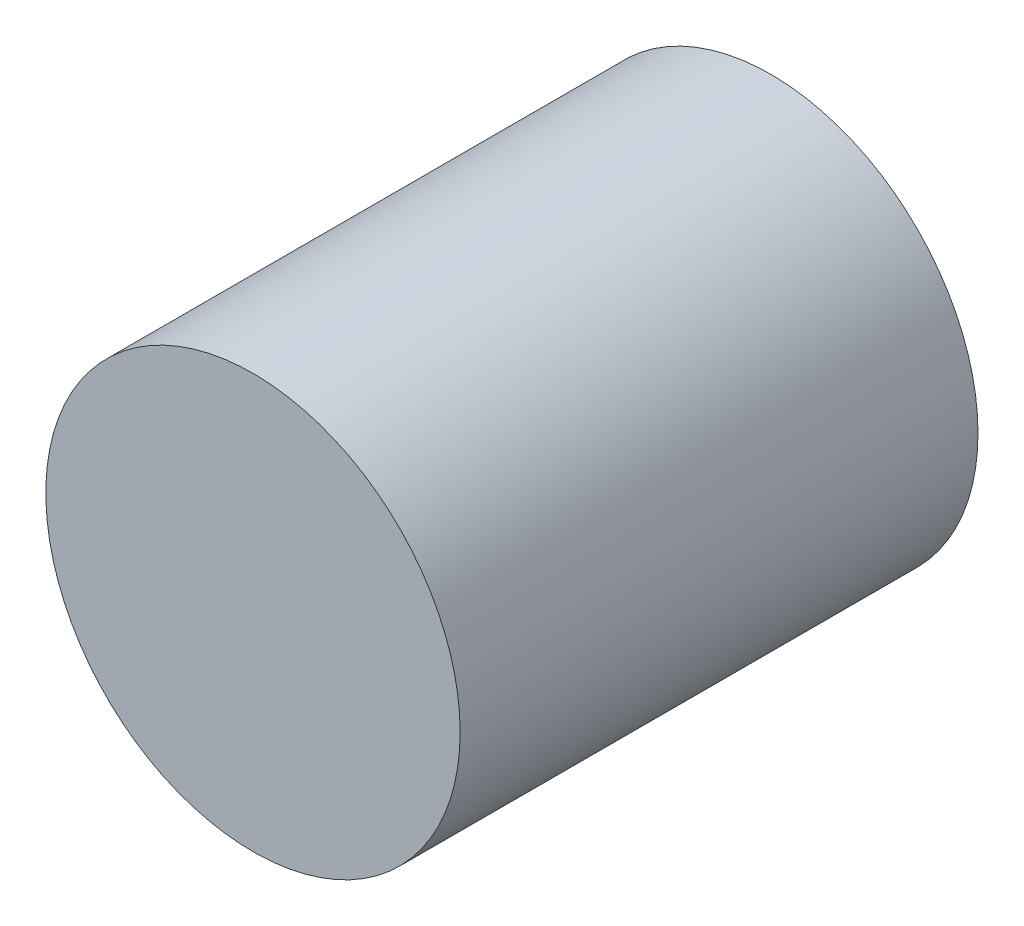
ISO-10303-21;
HEADER;
FILE_DESCRIPTION(('STEP AP214'),'2;1');
FILE_NAME('part.step','',(''),(''),'','','');
FILE_SCHEMA(('AUTOMOTIVE_DESIGN { 1 0 10303 214 1 1 1 1 }'));
ENDSEC;
DATA;
#1=APPLICATION_CONTEXT('core data for automotive mechanical design processes');
#2=APPLICATION_PROTOCOL_DEFINITION('international standard','automotive_design',2000,#1);
#3=PRODUCT_CONTEXT('',#1,'mechanical');
#4=PRODUCT('Part','Part','',(#3));
#5=PRODUCT_RELATED_PRODUCT_CATEGORY('part','',(#4));
#6=PRODUCT_DEFINITION_FORMATION('','',#4);
#7=PRODUCT_DEFINITION_CONTEXT('part definition',#1,'design');
#8=PRODUCT_DEFINITION('design','',#6,#7);
#9=PRODUCT_DEFINITION_SHAPE('','',#8);
#10=(LENGTH_UNIT() NAMED_UNIT(*) SI_UNIT(.MILLI.,.METRE.));
#11=(NAMED_UNIT(*) PLANE_ANGLE_UNIT() SI_UNIT($,.RADIAN.));
#12=(NAMED_UNIT(*) SI_UNIT($,.STERADIAN.) SOLID_ANGLE_UNIT());
#13=UNCERTAINTY_MEASURE_WITH_UNIT(LENGTH_MEASURE(1.E-05),#10,'distance_accuracy_value','');
#14=(GEOMETRIC_REPRESENTATION_CONTEXT(3) GLOBAL_UNCERTAINTY_ASSIGNED_CONTEXT((#13)) GLOBAL_UNIT_ASSIGNED_CONTEXT((#10,
#11,#12)) REPRESENTATION_CONTEXT('',''));
#15=CARTESIAN_POINT('',(0.,0.,0.));
#16=DIRECTION('',(0.,0.,1.));
#17=DIRECTION('',(1.,0.,0.));
#18=AXIS2_PLACEMENT_3D('',#15,#16,#17);
#19=CARTESIAN_POINT('',(0.,0.,15.));
#20=DIRECTION('',(0.,0.,-1.));
#21=DIRECTION('',(-1.,0.,0.));
#22=AXIS2_PLACEMENT_3D('',#19,#20,#21);
#23=CYLINDRICAL_SURFACE('',#22,6.);
#24=CARTESIAN_POINT('',(0.,0.,15.));
#25=DIRECTION('',(0.,0.,1.));
#26=DIRECTION('',(1.,0.,0.));
#27=AXIS2_PLACEMENT_3D('',#24,#25,#26);
#28=CIRCLE('',#27,6.);
#29=CARTESIAN_POINT('',(6.,0.,15.));
#30=VERTEX_POINT('',#29);
#31=EDGE_CURVE('E10',#30,#30,#28,.T.);
#32=ORIENTED_EDGE('',*,*,#31,.F.);
#33=EDGE_LOOP('',(#32));
#34=FACE_BOUND('',#33,.T.);
#35=CARTESIAN_POINT('',(0.,0.,0.));
#36=DIRECTION('',(0.,0.,1.));
#37=DIRECTION('',(1.,0.,0.));
#38=AXIS2_PLACEMENT_3D('',#35,#36,#37);
#39=CIRCLE('',#38,6.);
#40=CARTESIAN_POINT('',(6.,0.,0.));
#41=VERTEX_POINT('',#40);
#42=EDGE_CURVE('E34',#41,#41,#39,.T.);
#43=ORIENTED_EDGE('',*,*,#42,.T.);
#44=EDGE_LOOP('',(#43));
#45=FACE_BOUND('',#44,.T.);
#46=ADVANCED_FACE('F31',(#34,#45),#23,.T.);
#47=CARTESIAN_POINT('',(0.,0.,15.));
#48=DIRECTION('',(0.,0.,1.));
#49=DIRECTION('',(1.,0.,0.));
#50=AXIS2_PLACEMENT_3D('',#47,#48,#49);
#51=PLANE('',#50);
#52=ORIENTED_EDGE('',*,*,#31,.T.);
#53=EDGE_LOOP('',(#52));
#54=FACE_BOUND('',#53,.T.);
#55=ADVANCED_FACE('F46',(#54),#51,.T.);
#56=CARTESIAN_POINT('',(0.,0.,0.));
#57=DIRECTION('',(0.,0.,1.));
#58=DIRECTION('',(1.,0.,0.));
#59=AXIS2_PLACEMENT_3D('',#56,#57,#58);
#60=PLANE('',#59);
#61=ORIENTED_EDGE('',*,*,#42,.F.);
#62=EDGE_LOOP('',(#61));
#63=FACE_BOUND('',#62,.T.);
#64=ADVANCED_FACE('F44',(#63),#60,.F.);
#65=CLOSED_SHELL('',(#46,#55,#64));
#66=MANIFOLD_SOLID_BREP('B2',#65);
#67=ADVANCED_BREP_SHAPE_REPRESENTATION('',(#18,#66),#14);
#68=SHAPE_DEFINITION_REPRESENTATION(#9,#67);
ENDSEC;
END-ISO-10303-21;
